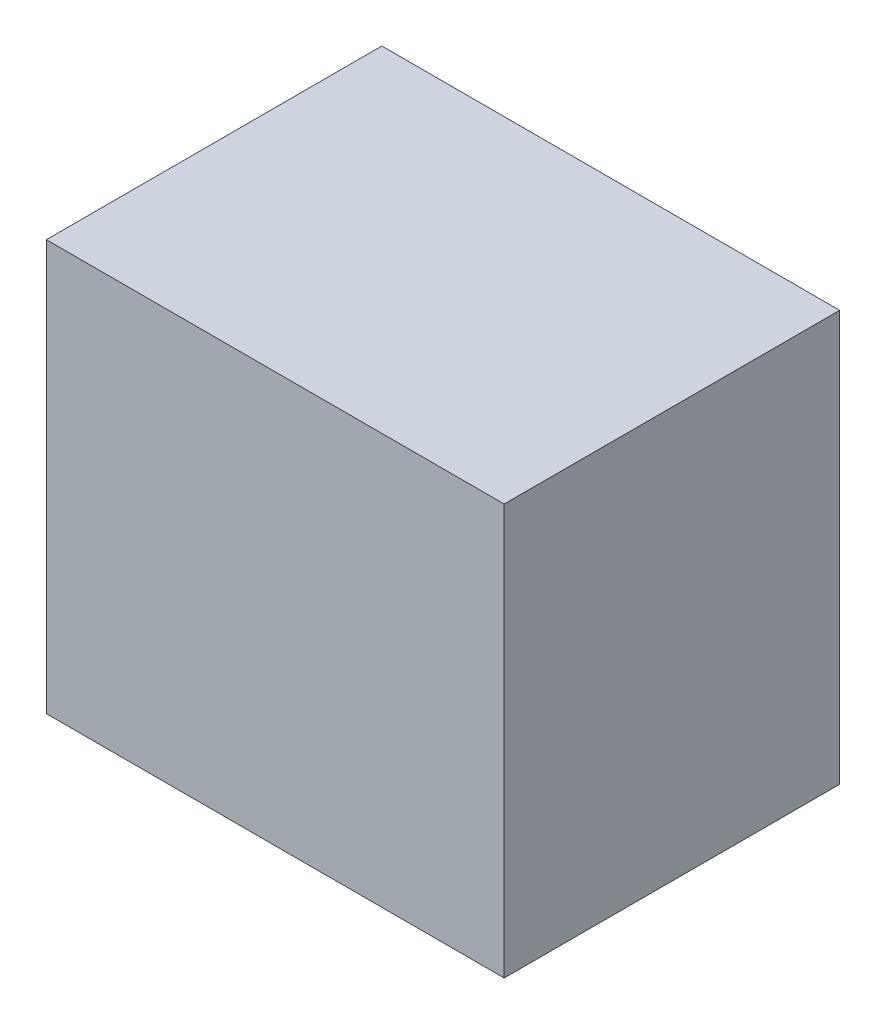
ISO-10303-21;
HEADER;
FILE_DESCRIPTION(('STEP AP214'),'2;1');
FILE_NAME('part.step','',(''),(''),'','','');
FILE_SCHEMA(('AUTOMOTIVE_DESIGN { 1 0 10303 214 1 1 1 1 }'));
ENDSEC;
DATA;
#1=APPLICATION_CONTEXT('core data for automotive mechanical design processes');
#2=APPLICATION_PROTOCOL_DEFINITION('international standard','automotive_design',2000,#1);
#3=PRODUCT_CONTEXT('',#1,'mechanical');
#4=PRODUCT('Part','Part','',(#3));
#5=PRODUCT_RELATED_PRODUCT_CATEGORY('part','',(#4));
#6=PRODUCT_DEFINITION_FORMATION('','',#4);
#7=PRODUCT_DEFINITION_CONTEXT('part definition',#1,'design');
#8=PRODUCT_DEFINITION('design','',#6,#7);
#9=PRODUCT_DEFINITION_SHAPE('','',#8);
#10=(LENGTH_UNIT() NAMED_UNIT(*) SI_UNIT(.MILLI.,.METRE.));
#11=(NAMED_UNIT(*) PLANE_ANGLE_UNIT() SI_UNIT($,.RADIAN.));
#12=(NAMED_UNIT(*) SI_UNIT($,.STERADIAN.) SOLID_ANGLE_UNIT());
#13=UNCERTAINTY_MEASURE_WITH_UNIT(LENGTH_MEASURE(1.E-05),#10,'distance_accuracy_value','');
#14=(GEOMETRIC_REPRESENTATION_CONTEXT(3) GLOBAL_UNCERTAINTY_ASSIGNED_CONTEXT((#13)) GLOBAL_UNIT_ASSIGNED_CONTEXT((#10,
#11,#12)) REPRESENTATION_CONTEXT('',''));
#15=CARTESIAN_POINT('',(0.,0.,0.));
#16=DIRECTION('',(0.,0.,1.));
#17=DIRECTION('',(1.,0.,0.));
#18=AXIS2_PLACEMENT_3D('',#15,#16,#17);
#19=CARTESIAN_POINT('',(-5.8,10.4,4.25));
#20=DIRECTION('',(1.,0.,0.));
#21=DIRECTION('',(0.,0.,-1.));
#22=AXIS2_PLACEMENT_3D('',#19,#20,#21);
#23=PLANE('',#22);
#24=DIRECTION('',(0.,0.,1.));
#25=VECTOR('',#24,1.);
#26=CARTESIAN_POINT('',(-5.8,0.,4.25));
#27=LINE('',#26,#25);
#28=CARTESIAN_POINT('',(-5.8,0.,-4.25));
#29=VERTEX_POINT('',#28);
#30=CARTESIAN_POINT('',(-5.8,0.,4.25));
#31=VERTEX_POINT('',#30);
#32=EDGE_CURVE('E100',#29,#31,#27,.T.);
#33=ORIENTED_EDGE('',*,*,#32,.T.);
#34=DIRECTION('',(0.,-1.,0.));
#35=VECTOR('',#34,1.);
#36=CARTESIAN_POINT('',(-5.8,10.4,4.25));
#37=LINE('',#36,#35);
#38=CARTESIAN_POINT('',(-5.8,10.4,4.25));
#39=VERTEX_POINT('',#38);
#40=EDGE_CURVE('E11',#39,#31,#37,.T.);
#41=ORIENTED_EDGE('',*,*,#40,.F.);
#42=DIRECTION('',(0.,0.,1.));
#43=VECTOR('',#42,1.);
#44=CARTESIAN_POINT('',(-5.8,10.4,4.25));
#45=LINE('',#44,#43);
#46=CARTESIAN_POINT('',(-5.8,10.4,-4.25));
#47=VERTEX_POINT('',#46);
#48=EDGE_CURVE('E88',#47,#39,#45,.T.);
#49=ORIENTED_EDGE('',*,*,#48,.F.);
#50=DIRECTION('',(0.,-1.,0.));
#51=VECTOR('',#50,1.);
#52=CARTESIAN_POINT('',(-5.8,10.4,-4.25));
#53=LINE('',#52,#51);
#54=EDGE_CURVE('E96',#47,#29,#53,.T.);
#55=ORIENTED_EDGE('',*,*,#54,.T.);
#56=EDGE_LOOP('',(#33,#41,#49,#55));
#57=FACE_BOUND('',#56,.T.);
#58=ADVANCED_FACE('F37',(#57),#23,.F.);
#59=CARTESIAN_POINT('',(5.8,10.4,4.25));
#60=DIRECTION('',(0.,0.,-1.));
#61=DIRECTION('',(-1.,0.,0.));
#62=AXIS2_PLACEMENT_3D('',#59,#60,#61);
#63=PLANE('',#62);
#64=DIRECTION('',(1.,0.,0.));
#65=VECTOR('',#64,1.);
#66=CARTESIAN_POINT('',(5.8,0.,4.25));
#67=LINE('',#66,#65);
#68=CARTESIAN_POINT('',(5.8,0.,4.25));
#69=VERTEX_POINT('',#68);
#70=EDGE_CURVE('E92',#31,#69,#67,.T.);
#71=ORIENTED_EDGE('',*,*,#70,.T.);
#72=DIRECTION('',(0.,-1.,0.));
#73=VECTOR('',#72,1.);
#74=CARTESIAN_POINT('',(5.8,10.4,4.25));
#75=LINE('',#74,#73);
#76=CARTESIAN_POINT('',(5.8,10.4,4.25));
#77=VERTEX_POINT('',#76);
#78=EDGE_CURVE('E45',#77,#69,#75,.T.);
#79=ORIENTED_EDGE('',*,*,#78,.F.);
#80=DIRECTION('',(1.,0.,0.));
#81=VECTOR('',#80,1.);
#82=CARTESIAN_POINT('',(5.8,10.4,4.25));
#83=LINE('',#82,#81);
#84=EDGE_CURVE('E83',#39,#77,#83,.T.);
#85=ORIENTED_EDGE('',*,*,#84,.F.);
#86=ORIENTED_EDGE('',*,*,#40,.T.);
#87=EDGE_LOOP('',(#71,#79,#85,#86));
#88=FACE_BOUND('',#87,.T.);
#89=ADVANCED_FACE('F91',(#88),#63,.F.);
#90=CARTESIAN_POINT('',(5.8,10.4,4.25));
#91=DIRECTION('',(-1.,0.,0.));
#92=DIRECTION('',(0.,0.,1.));
#93=AXIS2_PLACEMENT_3D('',#90,#91,#92);
#94=PLANE('',#93);
#95=DIRECTION('',(0.,0.,-1.));
#96=VECTOR('',#95,1.);
#97=CARTESIAN_POINT('',(5.8,0.,4.25));
#98=LINE('',#97,#96);
#99=CARTESIAN_POINT('',(5.8,0.,-4.25));
#100=VERTEX_POINT('',#99);
#101=EDGE_CURVE('E70',#69,#100,#98,.T.);
#102=ORIENTED_EDGE('',*,*,#101,.T.);
#103=DIRECTION('',(0.,-1.,0.));
#104=VECTOR('',#103,1.);
#105=CARTESIAN_POINT('',(5.8,10.4,-4.25));
#106=LINE('',#105,#104);
#107=CARTESIAN_POINT('',(5.8,10.4,-4.25));
#108=VERTEX_POINT('',#107);
#109=EDGE_CURVE('E93',#108,#100,#106,.T.);
#110=ORIENTED_EDGE('',*,*,#109,.F.);
#111=DIRECTION('',(0.,0.,-1.));
#112=VECTOR('',#111,1.);
#113=CARTESIAN_POINT('',(5.8,10.4,4.25));
#114=LINE('',#113,#112);
#115=EDGE_CURVE('E86',#77,#108,#114,.T.);
#116=ORIENTED_EDGE('',*,*,#115,.F.);
#117=ORIENTED_EDGE('',*,*,#78,.T.);
#118=EDGE_LOOP('',(#102,#110,#116,#117));
#119=FACE_BOUND('',#118,.T.);
#120=ADVANCED_FACE('F94',(#119),#94,.F.);
#121=CARTESIAN_POINT('',(5.8,10.4,-4.25));
#122=DIRECTION('',(0.,0.,1.));
#123=DIRECTION('',(1.,0.,0.));
#124=AXIS2_PLACEMENT_3D('',#121,#122,#123);
#125=PLANE('',#124);
#126=DIRECTION('',(-1.,0.,0.));
#127=VECTOR('',#126,1.);
#128=CARTESIAN_POINT('',(5.8,0.,-4.25));
#129=LINE('',#128,#127);
#130=EDGE_CURVE('E76',#100,#29,#129,.T.);
#131=ORIENTED_EDGE('',*,*,#130,.T.);
#132=ORIENTED_EDGE('',*,*,#54,.F.);
#133=DIRECTION('',(-1.,0.,0.));
#134=VECTOR('',#133,1.);
#135=CARTESIAN_POINT('',(5.8,10.4,-4.25));
#136=LINE('',#135,#134);
#137=EDGE_CURVE('E53',#108,#47,#136,.T.);
#138=ORIENTED_EDGE('',*,*,#137,.F.);
#139=ORIENTED_EDGE('',*,*,#109,.T.);
#140=EDGE_LOOP('',(#131,#132,#138,#139));
#141=FACE_BOUND('',#140,.T.);
#142=ADVANCED_FACE('F107',(#141),#125,.F.);
#143=CARTESIAN_POINT('',(0.,10.4,0.));
#144=DIRECTION('',(0.,1.,0.));
#145=DIRECTION('',(0.,0.,1.));
#146=AXIS2_PLACEMENT_3D('',#143,#144,#145);
#147=PLANE('',#146);
#148=ORIENTED_EDGE('',*,*,#48,.T.);
#149=ORIENTED_EDGE('',*,*,#84,.T.);
#150=ORIENTED_EDGE('',*,*,#115,.T.);
#151=ORIENTED_EDGE('',*,*,#137,.T.);
#152=EDGE_LOOP('',(#148,#149,#150,#151));
#153=FACE_BOUND('',#152,.T.);
#154=ADVANCED_FACE('F84',(#153),#147,.T.);
#155=CARTESIAN_POINT('',(0.,0.,0.));
#156=DIRECTION('',(0.,1.,0.));
#157=DIRECTION('',(0.,0.,1.));
#158=AXIS2_PLACEMENT_3D('',#155,#156,#157);
#159=PLANE('',#158);
#160=ORIENTED_EDGE('',*,*,#32,.F.);
#161=ORIENTED_EDGE('',*,*,#130,.F.);
#162=ORIENTED_EDGE('',*,*,#101,.F.);
#163=ORIENTED_EDGE('',*,*,#70,.F.);
#164=EDGE_LOOP('',(#160,#161,#162,#163));
#165=FACE_BOUND('',#164,.T.);
#166=ADVANCED_FACE('F110',(#165),#159,.F.);
#167=CLOSED_SHELL('',(#58,#89,#120,#142,#154,#166));
#168=MANIFOLD_SOLID_BREP('B2',#167);
#169=ADVANCED_BREP_SHAPE_REPRESENTATION('',(#18,#168),#14);
#170=SHAPE_DEFINITION_REPRESENTATION(#9,#169);
ENDSEC;
END-ISO-10303-21;
